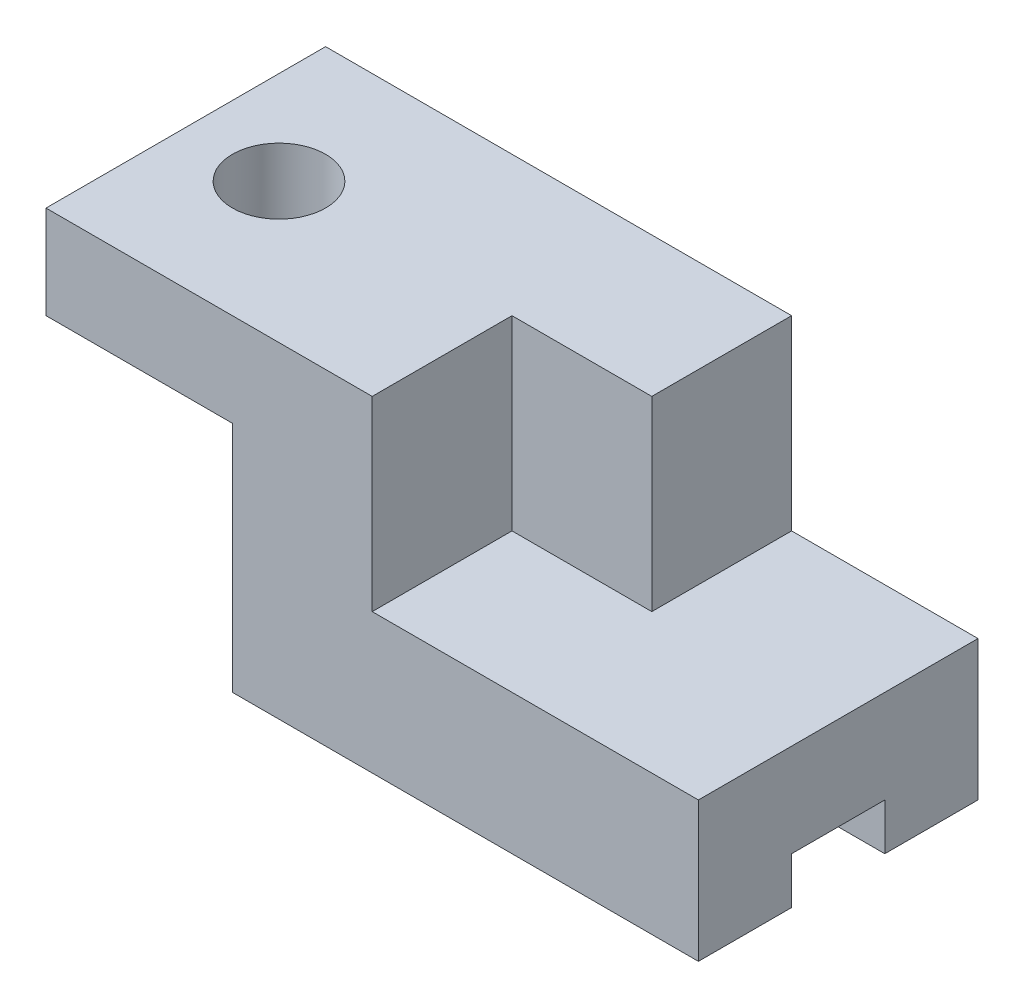
ISO-10303-21;
HEADER;
FILE_DESCRIPTION(('STEP AP214'),'2;1');
FILE_NAME('part.step','',(''),(''),'','','');
FILE_SCHEMA(('AUTOMOTIVE_DESIGN { 1 0 10303 214 1 1 1 1 }'));
ENDSEC;
DATA;
#1=APPLICATION_CONTEXT('core data for automotive mechanical design processes');
#2=APPLICATION_PROTOCOL_DEFINITION('international standard','automotive_design',2000,#1);
#3=PRODUCT_CONTEXT('',#1,'mechanical');
#4=PRODUCT('Part','Part','',(#3));
#5=PRODUCT_RELATED_PRODUCT_CATEGORY('part','',(#4));
#6=PRODUCT_DEFINITION_FORMATION('','',#4);
#7=PRODUCT_DEFINITION_CONTEXT('part definition',#1,'design');
#8=PRODUCT_DEFINITION('design','',#6,#7);
#9=PRODUCT_DEFINITION_SHAPE('','',#8);
#10=(LENGTH_UNIT() NAMED_UNIT(*) SI_UNIT(.MILLI.,.METRE.));
#11=(NAMED_UNIT(*) PLANE_ANGLE_UNIT() SI_UNIT($,.RADIAN.));
#12=(NAMED_UNIT(*) SI_UNIT($,.STERADIAN.) SOLID_ANGLE_UNIT());
#13=UNCERTAINTY_MEASURE_WITH_UNIT(LENGTH_MEASURE(1.E-05),#10,'distance_accuracy_value','');
#14=(GEOMETRIC_REPRESENTATION_CONTEXT(3) GLOBAL_UNCERTAINTY_ASSIGNED_CONTEXT((#13)) GLOBAL_UNIT_ASSIGNED_CONTEXT((#10,
#11,#12)) REPRESENTATION_CONTEXT('',''));
#15=CARTESIAN_POINT('',(0.,0.,0.));
#16=DIRECTION('',(0.,0.,1.));
#17=DIRECTION('',(1.,0.,0.));
#18=AXIS2_PLACEMENT_3D('',#15,#16,#17);
#19=CARTESIAN_POINT('',(0.,0.,0.));
#20=DIRECTION('',(0.,-1.,0.));
#21=DIRECTION('',(0.,0.,-1.));
#22=AXIS2_PLACEMENT_3D('',#19,#20,#21);
#23=PLANE('',#22);
#24=DIRECTION('',(0.,0.,1.));
#25=VECTOR('',#24,1.);
#26=CARTESIAN_POINT('',(20.,0.,-30.));
#27=LINE('',#26,#25);
#28=CARTESIAN_POINT('',(20.,0.,-10.));
#29=VERTEX_POINT('',#28);
#30=CARTESIAN_POINT('',(20.,0.,0.));
#31=VERTEX_POINT('',#30);
#32=EDGE_CURVE('E189',#29,#31,#27,.T.);
#33=ORIENTED_EDGE('',*,*,#32,.F.);
#34=DIRECTION('',(1.,0.,0.));
#35=VECTOR('',#34,1.);
#36=CARTESIAN_POINT('',(0.,0.,-10.));
#37=LINE('',#36,#35);
#38=CARTESIAN_POINT('',(70.,0.,-10.));
#39=VERTEX_POINT('',#38);
#40=EDGE_CURVE('E55',#29,#39,#37,.T.);
#41=ORIENTED_EDGE('',*,*,#40,.T.);
#42=DIRECTION('',(0.,0.,-1.));
#43=VECTOR('',#42,1.);
#44=CARTESIAN_POINT('',(70.,0.,0.));
#45=LINE('',#44,#43);
#46=CARTESIAN_POINT('',(70.,0.,0.));
#47=VERTEX_POINT('',#46);
#48=EDGE_CURVE('E269',#47,#39,#45,.T.);
#49=ORIENTED_EDGE('',*,*,#48,.F.);
#50=DIRECTION('',(1.,0.,0.));
#51=VECTOR('',#50,1.);
#52=CARTESIAN_POINT('',(0.,0.,0.));
#53=LINE('',#52,#51);
#54=EDGE_CURVE('E244',#31,#47,#53,.T.);
#55=ORIENTED_EDGE('',*,*,#54,.F.);
#56=EDGE_LOOP('',(#33,#41,#49,#55));
#57=FACE_BOUND('',#56,.T.);
#58=ADVANCED_FACE('F39',(#57),#23,.T.);
#59=CARTESIAN_POINT('',(70.,35.,0.));
#60=DIRECTION('',(-1.,0.,0.));
#61=DIRECTION('',(0.,0.,1.));
#62=AXIS2_PLACEMENT_3D('',#59,#60,#61);
#63=PLANE('',#62);
#64=DIRECTION('',(0.,0.,-1.));
#65=VECTOR('',#64,1.);
#66=CARTESIAN_POINT('',(70.,5.,-10.));
#67=LINE('',#66,#65);
#68=CARTESIAN_POINT('',(70.,5.,-10.));
#69=VERTEX_POINT('',#68);
#70=CARTESIAN_POINT('',(70.,5.,-20.));
#71=VERTEX_POINT('',#70);
#72=EDGE_CURVE('E147',#69,#71,#67,.T.);
#73=ORIENTED_EDGE('',*,*,#72,.T.);
#74=DIRECTION('',(0.,1.,0.));
#75=VECTOR('',#74,1.);
#76=CARTESIAN_POINT('',(70.,0.,-20.));
#77=LINE('',#76,#75);
#78=CARTESIAN_POINT('',(70.,0.,-20.));
#79=VERTEX_POINT('',#78);
#80=EDGE_CURVE('E156',#79,#71,#77,.T.);
#81=ORIENTED_EDGE('',*,*,#80,.F.);
#82=CARTESIAN_POINT('',(70.,0.,-30.));
#83=VERTEX_POINT('',#82);
#84=EDGE_CURVE('E268',#79,#83,#45,.T.);
#85=ORIENTED_EDGE('',*,*,#84,.T.);
#86=DIRECTION('',(0.,-1.,0.));
#87=VECTOR('',#86,1.);
#88=CARTESIAN_POINT('',(70.,35.,-30.));
#89=LINE('',#88,#87);
#90=CARTESIAN_POINT('',(70.,15.,-30.));
#91=VERTEX_POINT('',#90);
#92=EDGE_CURVE('E278',#91,#83,#89,.T.);
#93=ORIENTED_EDGE('',*,*,#92,.F.);
#94=DIRECTION('',(0.,0.,-1.));
#95=VECTOR('',#94,1.);
#96=CARTESIAN_POINT('',(70.,15.,0.));
#97=LINE('',#96,#95);
#98=CARTESIAN_POINT('',(70.,15.,0.));
#99=VERTEX_POINT('',#98);
#100=EDGE_CURVE('E207',#99,#91,#97,.T.);
#101=ORIENTED_EDGE('',*,*,#100,.F.);
#102=DIRECTION('',(0.,-1.,0.));
#103=VECTOR('',#102,1.);
#104=CARTESIAN_POINT('',(70.,35.,0.));
#105=LINE('',#104,#103);
#106=EDGE_CURVE('E282',#99,#47,#105,.T.);
#107=ORIENTED_EDGE('',*,*,#106,.T.);
#108=ORIENTED_EDGE('',*,*,#48,.T.);
#109=DIRECTION('',(0.,1.,0.));
#110=VECTOR('',#109,1.);
#111=CARTESIAN_POINT('',(70.,0.,-10.));
#112=LINE('',#111,#110);
#113=EDGE_CURVE('E162',#39,#69,#112,.T.);
#114=ORIENTED_EDGE('',*,*,#113,.T.);
#115=EDGE_LOOP('',(#73,#81,#85,#93,#101,#107,#108,#114));
#116=FACE_BOUND('',#115,.T.);
#117=ADVANCED_FACE('F164',(#116),#63,.F.);
#118=CARTESIAN_POINT('',(0.,35.,0.));
#119=DIRECTION('',(1.,0.,0.));
#120=DIRECTION('',(0.,0.,-1.));
#121=AXIS2_PLACEMENT_3D('',#118,#119,#120);
#122=PLANE('',#121);
#123=DIRECTION('',(0.,-1.,0.));
#124=VECTOR('',#123,1.);
#125=CARTESIAN_POINT('',(0.,35.,-30.));
#126=LINE('',#125,#124);
#127=CARTESIAN_POINT('',(0.,35.,-30.));
#128=VERTEX_POINT('',#127);
#129=CARTESIAN_POINT('',(0.,25.,-30.));
#130=VERTEX_POINT('',#129);
#131=EDGE_CURVE('E265',#128,#130,#126,.T.);
#132=ORIENTED_EDGE('',*,*,#131,.T.);
#133=DIRECTION('',(0.,0.,1.));
#134=VECTOR('',#133,1.);
#135=CARTESIAN_POINT('',(0.,25.,-30.));
#136=LINE('',#135,#134);
#137=CARTESIAN_POINT('',(0.,25.,0.));
#138=VERTEX_POINT('',#137);
#139=EDGE_CURVE('E196',#130,#138,#136,.T.);
#140=ORIENTED_EDGE('',*,*,#139,.T.);
#141=DIRECTION('',(0.,-1.,0.));
#142=VECTOR('',#141,1.);
#143=CARTESIAN_POINT('',(0.,35.,0.));
#144=LINE('',#143,#142);
#145=CARTESIAN_POINT('',(0.,35.,0.));
#146=VERTEX_POINT('',#145);
#147=EDGE_CURVE('E286',#146,#138,#144,.T.);
#148=ORIENTED_EDGE('',*,*,#147,.F.);
#149=DIRECTION('',(0.,0.,1.));
#150=VECTOR('',#149,1.);
#151=CARTESIAN_POINT('',(0.,35.,0.));
#152=LINE('',#151,#150);
#153=EDGE_CURVE('E253',#128,#146,#152,.T.);
#154=ORIENTED_EDGE('',*,*,#153,.F.);
#155=EDGE_LOOP('',(#132,#140,#148,#154));
#156=FACE_BOUND('',#155,.T.);
#157=ADVANCED_FACE('F41',(#156),#122,.F.);
#158=CARTESIAN_POINT('',(0.,35.,0.));
#159=DIRECTION('',(0.,0.,-1.));
#160=DIRECTION('',(-1.,0.,0.));
#161=AXIS2_PLACEMENT_3D('',#158,#159,#160);
#162=PLANE('',#161);
#163=ORIENTED_EDGE('',*,*,#147,.T.);
#164=DIRECTION('',(-1.,0.,0.));
#165=VECTOR('',#164,1.);
#166=CARTESIAN_POINT('',(0.,25.,0.));
#167=LINE('',#166,#165);
#168=CARTESIAN_POINT('',(20.,25.,0.));
#169=VERTEX_POINT('',#168);
#170=EDGE_CURVE('E185',#169,#138,#167,.T.);
#171=ORIENTED_EDGE('',*,*,#170,.F.);
#172=DIRECTION('',(0.,1.,0.));
#173=VECTOR('',#172,1.);
#174=CARTESIAN_POINT('',(20.,25.,0.));
#175=LINE('',#174,#173);
#176=EDGE_CURVE('E190',#31,#169,#175,.T.);
#177=ORIENTED_EDGE('',*,*,#176,.F.);
#178=ORIENTED_EDGE('',*,*,#54,.T.);
#179=ORIENTED_EDGE('',*,*,#106,.F.);
#180=DIRECTION('',(1.,0.,0.));
#181=VECTOR('',#180,1.);
#182=CARTESIAN_POINT('',(35.,15.,0.));
#183=LINE('',#182,#181);
#184=CARTESIAN_POINT('',(35.,15.,0.));
#185=VERTEX_POINT('',#184);
#186=EDGE_CURVE('E227',#185,#99,#183,.T.);
#187=ORIENTED_EDGE('',*,*,#186,.F.);
#188=DIRECTION('',(0.,1.,0.));
#189=VECTOR('',#188,1.);
#190=CARTESIAN_POINT('',(35.,15.,0.));
#191=LINE('',#190,#189);
#192=CARTESIAN_POINT('',(35.,35.,0.));
#193=VERTEX_POINT('',#192);
#194=EDGE_CURVE('E240',#185,#193,#191,.T.);
#195=ORIENTED_EDGE('',*,*,#194,.T.);
#196=DIRECTION('',(1.,0.,0.));
#197=VECTOR('',#196,1.);
#198=CARTESIAN_POINT('',(0.,35.,0.));
#199=LINE('',#198,#197);
#200=EDGE_CURVE('E257',#146,#193,#199,.T.);
#201=ORIENTED_EDGE('',*,*,#200,.F.);
#202=EDGE_LOOP('',(#163,#171,#177,#178,#179,#187,#195,#201));
#203=FACE_BOUND('',#202,.T.);
#204=ADVANCED_FACE('F305',(#203),#162,.F.);
#205=CARTESIAN_POINT('',(0.,35.,-30.));
#206=DIRECTION('',(0.,0.,1.));
#207=DIRECTION('',(1.,0.,0.));
#208=AXIS2_PLACEMENT_3D('',#205,#206,#207);
#209=PLANE('',#208);
#210=DIRECTION('',(0.,1.,0.));
#211=VECTOR('',#210,1.);
#212=CARTESIAN_POINT('',(20.,25.,-30.));
#213=LINE('',#212,#211);
#214=CARTESIAN_POINT('',(20.,0.,-30.));
#215=VERTEX_POINT('',#214);
#216=CARTESIAN_POINT('',(20.,25.,-30.));
#217=VERTEX_POINT('',#216);
#218=EDGE_CURVE('E63',#215,#217,#213,.T.);
#219=ORIENTED_EDGE('',*,*,#218,.T.);
#220=DIRECTION('',(-1.,0.,0.));
#221=VECTOR('',#220,1.);
#222=CARTESIAN_POINT('',(0.,25.,-30.));
#223=LINE('',#222,#221);
#224=EDGE_CURVE('E184',#217,#130,#223,.T.);
#225=ORIENTED_EDGE('',*,*,#224,.T.);
#226=ORIENTED_EDGE('',*,*,#131,.F.);
#227=DIRECTION('',(-1.,0.,0.));
#228=VECTOR('',#227,1.);
#229=CARTESIAN_POINT('',(0.,35.,-30.));
#230=LINE('',#229,#228);
#231=CARTESIAN_POINT('',(50.,35.,-30.));
#232=VERTEX_POINT('',#231);
#233=EDGE_CURVE('E262',#232,#128,#230,.T.);
#234=ORIENTED_EDGE('',*,*,#233,.F.);
#235=DIRECTION('',(0.,1.,0.));
#236=VECTOR('',#235,1.);
#237=CARTESIAN_POINT('',(50.,15.,-30.));
#238=LINE('',#237,#236);
#239=CARTESIAN_POINT('',(50.,15.,-30.));
#240=VERTEX_POINT('',#239);
#241=EDGE_CURVE('E230',#240,#232,#238,.T.);
#242=ORIENTED_EDGE('',*,*,#241,.F.);
#243=DIRECTION('',(-1.,0.,0.));
#244=VECTOR('',#243,1.);
#245=CARTESIAN_POINT('',(70.,15.,-30.));
#246=LINE('',#245,#244);
#247=EDGE_CURVE('E210',#91,#240,#246,.T.);
#248=ORIENTED_EDGE('',*,*,#247,.F.);
#249=ORIENTED_EDGE('',*,*,#92,.T.);
#250=DIRECTION('',(-1.,0.,0.));
#251=VECTOR('',#250,1.);
#252=CARTESIAN_POINT('',(0.,0.,-30.));
#253=LINE('',#252,#251);
#254=EDGE_CURVE('E258',#83,#215,#253,.T.);
#255=ORIENTED_EDGE('',*,*,#254,.T.);
#256=EDGE_LOOP('',(#219,#225,#226,#234,#242,#248,#249,#255));
#257=FACE_BOUND('',#256,.T.);
#258=ADVANCED_FACE('F331',(#257),#209,.F.);
#259=CARTESIAN_POINT('',(0.,35.,0.));
#260=DIRECTION('',(0.,-1.,0.));
#261=DIRECTION('',(0.,0.,-1.));
#262=AXIS2_PLACEMENT_3D('',#259,#260,#261);
#263=PLANE('',#262);
#264=CARTESIAN_POINT('',(10.,35.,-15.));
#265=DIRECTION('',(0.,1.,0.));
#266=DIRECTION('',(0.,0.,1.));
#267=AXIS2_PLACEMENT_3D('',#264,#265,#266);
#268=CIRCLE('',#267,5.);
#269=CARTESIAN_POINT('',(10.,35.,-10.));
#270=VERTEX_POINT('',#269);
#271=EDGE_CURVE('E152',#270,#270,#268,.T.);
#272=ORIENTED_EDGE('',*,*,#271,.F.);
#273=EDGE_LOOP('',(#272));
#274=FACE_BOUND('',#273,.T.);
#275=ORIENTED_EDGE('',*,*,#200,.T.);
#276=DIRECTION('',(0.,0.,1.));
#277=VECTOR('',#276,1.);
#278=CARTESIAN_POINT('',(35.,35.,-15.));
#279=LINE('',#278,#277);
#280=CARTESIAN_POINT('',(35.,35.,-15.));
#281=VERTEX_POINT('',#280);
#282=EDGE_CURVE('E211',#281,#193,#279,.T.);
#283=ORIENTED_EDGE('',*,*,#282,.F.);
#284=DIRECTION('',(-1.,0.,0.));
#285=VECTOR('',#284,1.);
#286=CARTESIAN_POINT('',(50.,35.,-15.));
#287=LINE('',#286,#285);
#288=CARTESIAN_POINT('',(50.,35.,-15.));
#289=VERTEX_POINT('',#288);
#290=EDGE_CURVE('E234',#289,#281,#287,.T.);
#291=ORIENTED_EDGE('',*,*,#290,.F.);
#292=DIRECTION('',(0.,0.,1.));
#293=VECTOR('',#292,1.);
#294=CARTESIAN_POINT('',(50.,35.,-30.));
#295=LINE('',#294,#293);
#296=EDGE_CURVE('E200',#232,#289,#295,.T.);
#297=ORIENTED_EDGE('',*,*,#296,.F.);
#298=ORIENTED_EDGE('',*,*,#233,.T.);
#299=ORIENTED_EDGE('',*,*,#153,.T.);
#300=EDGE_LOOP('',(#275,#283,#291,#297,#298,#299));
#301=FACE_BOUND('',#300,.T.);
#302=ADVANCED_FACE('F321',(#274,#301),#263,.F.);
#303=DIRECTION('',(1.,0.,0.));
#304=VECTOR('',#303,1.);
#305=CARTESIAN_POINT('',(0.,0.,-20.));
#306=LINE('',#305,#304);
#307=CARTESIAN_POINT('',(20.,0.,-20.));
#308=VERTEX_POINT('',#307);
#309=EDGE_CURVE('E153',#308,#79,#306,.T.);
#310=ORIENTED_EDGE('',*,*,#309,.F.);
#311=EDGE_CURVE('E204',#215,#308,#27,.T.);
#312=ORIENTED_EDGE('',*,*,#311,.F.);
#313=ORIENTED_EDGE('',*,*,#254,.F.);
#314=ORIENTED_EDGE('',*,*,#84,.F.);
#315=EDGE_LOOP('',(#310,#312,#313,#314));
#316=FACE_BOUND('',#315,.T.);
#317=ADVANCED_FACE('F335',(#316),#23,.T.);
#318=CARTESIAN_POINT('',(35.,15.,-15.));
#319=DIRECTION('',(-1.,0.,0.));
#320=DIRECTION('',(0.,0.,1.));
#321=AXIS2_PLACEMENT_3D('',#318,#319,#320);
#322=PLANE('',#321);
#323=ORIENTED_EDGE('',*,*,#282,.T.);
#324=ORIENTED_EDGE('',*,*,#194,.F.);
#325=DIRECTION('',(0.,0.,1.));
#326=VECTOR('',#325,1.);
#327=CARTESIAN_POINT('',(35.,15.,-15.));
#328=LINE('',#327,#326);
#329=CARTESIAN_POINT('',(35.,15.,-15.));
#330=VERTEX_POINT('',#329);
#331=EDGE_CURVE('E223',#330,#185,#328,.T.);
#332=ORIENTED_EDGE('',*,*,#331,.F.);
#333=DIRECTION('',(0.,1.,0.));
#334=VECTOR('',#333,1.);
#335=CARTESIAN_POINT('',(35.,15.,-15.));
#336=LINE('',#335,#334);
#337=EDGE_CURVE('E245',#330,#281,#336,.T.);
#338=ORIENTED_EDGE('',*,*,#337,.T.);
#339=EDGE_LOOP('',(#323,#324,#332,#338));
#340=FACE_BOUND('',#339,.T.);
#341=ADVANCED_FACE('F317',(#340),#322,.F.);
#342=CARTESIAN_POINT('',(50.,15.,-15.));
#343=DIRECTION('',(0.,0.,-1.));
#344=DIRECTION('',(-1.,0.,0.));
#345=AXIS2_PLACEMENT_3D('',#342,#343,#344);
#346=PLANE('',#345);
#347=ORIENTED_EDGE('',*,*,#290,.T.);
#348=ORIENTED_EDGE('',*,*,#337,.F.);
#349=DIRECTION('',(-1.,0.,0.));
#350=VECTOR('',#349,1.);
#351=CARTESIAN_POINT('',(50.,15.,-15.));
#352=LINE('',#351,#350);
#353=CARTESIAN_POINT('',(50.,15.,-15.));
#354=VERTEX_POINT('',#353);
#355=EDGE_CURVE('E219',#354,#330,#352,.T.);
#356=ORIENTED_EDGE('',*,*,#355,.F.);
#357=DIRECTION('',(0.,1.,0.));
#358=VECTOR('',#357,1.);
#359=CARTESIAN_POINT('',(50.,15.,-15.));
#360=LINE('',#359,#358);
#361=EDGE_CURVE('E248',#354,#289,#360,.T.);
#362=ORIENTED_EDGE('',*,*,#361,.T.);
#363=EDGE_LOOP('',(#347,#348,#356,#362));
#364=FACE_BOUND('',#363,.T.);
#365=ADVANCED_FACE('F342',(#364),#346,.F.);
#366=CARTESIAN_POINT('',(50.,15.,-30.));
#367=DIRECTION('',(-1.,0.,0.));
#368=DIRECTION('',(0.,0.,1.));
#369=AXIS2_PLACEMENT_3D('',#366,#367,#368);
#370=PLANE('',#369);
#371=ORIENTED_EDGE('',*,*,#296,.T.);
#372=ORIENTED_EDGE('',*,*,#361,.F.);
#373=DIRECTION('',(0.,0.,1.));
#374=VECTOR('',#373,1.);
#375=CARTESIAN_POINT('',(50.,15.,-30.));
#376=LINE('',#375,#374);
#377=EDGE_CURVE('E215',#240,#354,#376,.T.);
#378=ORIENTED_EDGE('',*,*,#377,.F.);
#379=ORIENTED_EDGE('',*,*,#241,.T.);
#380=EDGE_LOOP('',(#371,#372,#378,#379));
#381=FACE_BOUND('',#380,.T.);
#382=ADVANCED_FACE('F437',(#381),#370,.F.);
#383=CARTESIAN_POINT('',(0.,15.,0.));
#384=DIRECTION('',(0.,1.,0.));
#385=DIRECTION('',(0.,0.,1.));
#386=AXIS2_PLACEMENT_3D('',#383,#384,#385);
#387=PLANE('',#386);
#388=ORIENTED_EDGE('',*,*,#100,.T.);
#389=ORIENTED_EDGE('',*,*,#247,.T.);
#390=ORIENTED_EDGE('',*,*,#377,.T.);
#391=ORIENTED_EDGE('',*,*,#355,.T.);
#392=ORIENTED_EDGE('',*,*,#331,.T.);
#393=ORIENTED_EDGE('',*,*,#186,.T.);
#394=EDGE_LOOP('',(#388,#389,#390,#391,#392,#393));
#395=FACE_BOUND('',#394,.T.);
#396=ADVANCED_FACE('F312',(#395),#387,.T.);
#397=CARTESIAN_POINT('',(0.,25.,-30.));
#398=DIRECTION('',(0.,1.,0.));
#399=DIRECTION('',(-1.,0.,0.));
#400=AXIS2_PLACEMENT_3D('',#397,#398,#399);
#401=PLANE('',#400);
#402=CARTESIAN_POINT('',(10.,25.,-15.));
#403=DIRECTION('',(0.,1.,0.));
#404=DIRECTION('',(-1.,0.,0.));
#405=AXIS2_PLACEMENT_3D('',#402,#403,#404);
#406=CIRCLE('',#405,5.);
#407=CARTESIAN_POINT('',(5.,25.,-15.));
#408=VERTEX_POINT('',#407);
#409=EDGE_CURVE('E181',#408,#408,#406,.T.);
#410=ORIENTED_EDGE('',*,*,#409,.T.);
#411=EDGE_LOOP('',(#410));
#412=FACE_BOUND('',#411,.T.);
#413=ORIENTED_EDGE('',*,*,#170,.T.);
#414=ORIENTED_EDGE('',*,*,#139,.F.);
#415=ORIENTED_EDGE('',*,*,#224,.F.);
#416=DIRECTION('',(0.,0.,1.));
#417=VECTOR('',#416,1.);
#418=CARTESIAN_POINT('',(20.,25.,-30.));
#419=LINE('',#418,#417);
#420=EDGE_CURVE('E201',#217,#169,#419,.T.);
#421=ORIENTED_EDGE('',*,*,#420,.T.);
#422=EDGE_LOOP('',(#413,#414,#415,#421));
#423=FACE_BOUND('',#422,.T.);
#424=ADVANCED_FACE('F329',(#412,#423),#401,.F.);
#425=CARTESIAN_POINT('',(20.,25.,-30.));
#426=DIRECTION('',(1.,0.,0.));
#427=DIRECTION('',(0.,0.,-1.));
#428=AXIS2_PLACEMENT_3D('',#425,#426,#427);
#429=PLANE('',#428);
#430=ORIENTED_EDGE('',*,*,#311,.T.);
#431=DIRECTION('',(0.,1.,0.));
#432=VECTOR('',#431,1.);
#433=CARTESIAN_POINT('',(20.,25.,-20.));
#434=LINE('',#433,#432);
#435=CARTESIAN_POINT('',(20.,5.,-20.));
#436=VERTEX_POINT('',#435);
#437=EDGE_CURVE('E11',#308,#436,#434,.T.);
#438=ORIENTED_EDGE('',*,*,#437,.T.);
#439=DIRECTION('',(0.,0.,-1.));
#440=VECTOR('',#439,1.);
#441=CARTESIAN_POINT('',(20.,5.,-30.));
#442=LINE('',#441,#440);
#443=CARTESIAN_POINT('',(20.,5.,-10.));
#444=VERTEX_POINT('',#443);
#445=EDGE_CURVE('E48',#444,#436,#442,.T.);
#446=ORIENTED_EDGE('',*,*,#445,.F.);
#447=DIRECTION('',(0.,1.,0.));
#448=VECTOR('',#447,1.);
#449=CARTESIAN_POINT('',(20.,25.,-10.));
#450=LINE('',#449,#448);
#451=EDGE_CURVE('E290',#29,#444,#450,.T.);
#452=ORIENTED_EDGE('',*,*,#451,.F.);
#453=ORIENTED_EDGE('',*,*,#32,.T.);
#454=ORIENTED_EDGE('',*,*,#176,.T.);
#455=ORIENTED_EDGE('',*,*,#420,.F.);
#456=ORIENTED_EDGE('',*,*,#218,.F.);
#457=EDGE_LOOP('',(#430,#438,#446,#452,#453,#454,#455,#456));
#458=FACE_BOUND('',#457,.T.);
#459=ADVANCED_FACE('F300',(#458),#429,.F.);
#460=CARTESIAN_POINT('',(10.,0.,-15.));
#461=DIRECTION('',(0.,1.,0.));
#462=DIRECTION('',(0.,0.,1.));
#463=AXIS2_PLACEMENT_3D('',#460,#461,#462);
#464=CYLINDRICAL_SURFACE('',#463,5.);
#465=ORIENTED_EDGE('',*,*,#271,.T.);
#466=EDGE_LOOP('',(#465));
#467=FACE_BOUND('',#466,.T.);
#468=ORIENTED_EDGE('',*,*,#409,.F.);
#469=EDGE_LOOP('',(#468));
#470=FACE_BOUND('',#469,.T.);
#471=ADVANCED_FACE('F384',(#467,#470),#464,.F.);
#472=CARTESIAN_POINT('',(0.,5.,-10.));
#473=DIRECTION('',(0.,-1.,0.));
#474=DIRECTION('',(0.,0.,-1.));
#475=AXIS2_PLACEMENT_3D('',#472,#473,#474);
#476=PLANE('',#475);
#477=ORIENTED_EDGE('',*,*,#445,.T.);
#478=DIRECTION('',(1.,0.,0.));
#479=VECTOR('',#478,1.);
#480=CARTESIAN_POINT('',(0.,5.,-20.));
#481=LINE('',#480,#479);
#482=EDGE_CURVE('E142',#436,#71,#481,.T.);
#483=ORIENTED_EDGE('',*,*,#482,.T.);
#484=ORIENTED_EDGE('',*,*,#72,.F.);
#485=DIRECTION('',(1.,0.,0.));
#486=VECTOR('',#485,1.);
#487=CARTESIAN_POINT('',(0.,5.,-10.));
#488=LINE('',#487,#486);
#489=EDGE_CURVE('E171',#444,#69,#488,.T.);
#490=ORIENTED_EDGE('',*,*,#489,.F.);
#491=EDGE_LOOP('',(#477,#483,#484,#490));
#492=FACE_BOUND('',#491,.T.);
#493=ADVANCED_FACE('F144',(#492),#476,.T.);
#494=CARTESIAN_POINT('',(0.,0.,-20.));
#495=DIRECTION('',(0.,0.,-1.));
#496=DIRECTION('',(-1.,0.,0.));
#497=AXIS2_PLACEMENT_3D('',#494,#495,#496);
#498=PLANE('',#497);
#499=ORIENTED_EDGE('',*,*,#309,.T.);
#500=ORIENTED_EDGE('',*,*,#80,.T.);
#501=ORIENTED_EDGE('',*,*,#482,.F.);
#502=ORIENTED_EDGE('',*,*,#437,.F.);
#503=EDGE_LOOP('',(#499,#500,#501,#502));
#504=FACE_BOUND('',#503,.T.);
#505=ADVANCED_FACE('F157',(#504),#498,.F.);
#506=CARTESIAN_POINT('',(0.,0.,-10.));
#507=DIRECTION('',(0.,0.,-1.));
#508=DIRECTION('',(-1.,0.,0.));
#509=AXIS2_PLACEMENT_3D('',#506,#507,#508);
#510=PLANE('',#509);
#511=ORIENTED_EDGE('',*,*,#451,.T.);
#512=ORIENTED_EDGE('',*,*,#489,.T.);
#513=ORIENTED_EDGE('',*,*,#113,.F.);
#514=ORIENTED_EDGE('',*,*,#40,.F.);
#515=EDGE_LOOP('',(#511,#512,#513,#514));
#516=FACE_BOUND('',#515,.T.);
#517=ADVANCED_FACE('F424',(#516),#510,.T.);
#518=CLOSED_SHELL('',(#58,#117,#157,#204,#258,#302,#317,#341,#365,#382,#396,#424,#459,#471,#493,
#505,#517));
#519=MANIFOLD_SOLID_BREP('B2',#518);
#520=ADVANCED_BREP_SHAPE_REPRESENTATION('',(#18,#519),#14);
#521=SHAPE_DEFINITION_REPRESENTATION(#9,#520);
ENDSEC;
END-ISO-10303-21;
